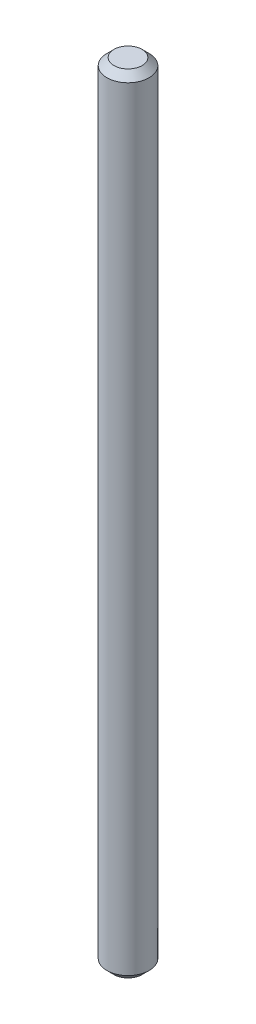
ISO-10303-21;
HEADER;
FILE_DESCRIPTION(('STEP AP214'),'2;1');
FILE_NAME('part.step','',(''),(''),'','','');
FILE_SCHEMA(('AUTOMOTIVE_DESIGN { 1 0 10303 214 1 1 1 1 }'));
ENDSEC;
DATA;
#1=APPLICATION_CONTEXT('core data for automotive mechanical design processes');
#2=APPLICATION_PROTOCOL_DEFINITION('international standard','automotive_design',2000,#1);
#3=PRODUCT_CONTEXT('',#1,'mechanical');
#4=PRODUCT('Part','Part','',(#3));
#5=PRODUCT_RELATED_PRODUCT_CATEGORY('part','',(#4));
#6=PRODUCT_DEFINITION_FORMATION('','',#4);
#7=PRODUCT_DEFINITION_CONTEXT('part definition',#1,'design');
#8=PRODUCT_DEFINITION('design','',#6,#7);
#9=PRODUCT_DEFINITION_SHAPE('','',#8);
#10=(LENGTH_UNIT() NAMED_UNIT(*) SI_UNIT(.MILLI.,.METRE.));
#11=(NAMED_UNIT(*) PLANE_ANGLE_UNIT() SI_UNIT($,.RADIAN.));
#12=(NAMED_UNIT(*) SI_UNIT($,.STERADIAN.) SOLID_ANGLE_UNIT());
#13=UNCERTAINTY_MEASURE_WITH_UNIT(LENGTH_MEASURE(1.E-05),#10,'distance_accuracy_value','');
#14=(GEOMETRIC_REPRESENTATION_CONTEXT(3) GLOBAL_UNCERTAINTY_ASSIGNED_CONTEXT((#13)) GLOBAL_UNIT_ASSIGNED_CONTEXT((#10,
#11,#12)) REPRESENTATION_CONTEXT('',''));
#15=CARTESIAN_POINT('',(0.,0.,0.));
#16=DIRECTION('',(0.,0.,1.));
#17=DIRECTION('',(1.,0.,0.));
#18=AXIS2_PLACEMENT_3D('',#15,#16,#17);
#19=CARTESIAN_POINT('',(0.,-51.,0.));
#20=DIRECTION('',(0.,-1.,0.));
#21=DIRECTION('',(0.,0.,-1.));
#22=AXIS2_PLACEMENT_3D('',#19,#20,#21);
#23=PLANE('',#22);
#24=CARTESIAN_POINT('',(0.,-51.,0.));
#25=DIRECTION('',(0.,-1.,0.));
#26=DIRECTION('',(0.,0.,-1.));
#27=AXIS2_PLACEMENT_3D('',#24,#25,#26);
#28=CIRCLE('',#27,1.00000000000001);
#29=CARTESIAN_POINT('',(0.,-51.,-1.00000000000001));
#30=VERTEX_POINT('',#29);
#31=EDGE_CURVE('E10',#30,#30,#28,.T.);
#32=ORIENTED_EDGE('',*,*,#31,.T.);
#33=EDGE_LOOP('',(#32));
#34=FACE_BOUND('',#33,.T.);
#35=ADVANCED_FACE('F28',(#34),#23,.T.);
#36=CARTESIAN_POINT('',(0.,-51.,0.));
#37=DIRECTION('',(0.,1.,0.));
#38=DIRECTION('',(0.,0.,1.));
#39=AXIS2_PLACEMENT_3D('',#36,#37,#38);
#40=CONICAL_SURFACE('',#39,1.00000000000001,0.785398163397454);
#41=CARTESIAN_POINT('',(0.,-50.5,0.));
#42=DIRECTION('',(0.,-1.,0.));
#43=DIRECTION('',(0.,0.,-1.));
#44=AXIS2_PLACEMENT_3D('',#41,#42,#43);
#45=CIRCLE('',#44,1.50000000000001);
#46=CARTESIAN_POINT('',(0.,-50.5,-1.50000000000001));
#47=VERTEX_POINT('',#46);
#48=EDGE_CURVE('E34',#47,#47,#45,.T.);
#49=ORIENTED_EDGE('',*,*,#48,.T.);
#50=EDGE_LOOP('',(#49));
#51=FACE_BOUND('',#50,.T.);
#52=ORIENTED_EDGE('',*,*,#31,.F.);
#53=EDGE_LOOP('',(#52));
#54=FACE_BOUND('',#53,.T.);
#55=ADVANCED_FACE('F60',(#51,#54),#40,.T.);
#56=CARTESIAN_POINT('',(0.,5.,0.));
#57=DIRECTION('',(0.,-1.,0.));
#58=DIRECTION('',(0.,0.,-1.));
#59=AXIS2_PLACEMENT_3D('',#56,#57,#58);
#60=CYLINDRICAL_SURFACE('',#59,1.5);
#61=CARTESIAN_POINT('',(0.,4.5,0.));
#62=DIRECTION('',(0.,-1.,0.));
#63=DIRECTION('',(0.,0.,-1.));
#64=AXIS2_PLACEMENT_3D('',#61,#62,#63);
#65=CIRCLE('',#64,1.5);
#66=CARTESIAN_POINT('',(0.,4.5,-1.5));
#67=VERTEX_POINT('',#66);
#68=EDGE_CURVE('E38',#67,#67,#65,.T.);
#69=ORIENTED_EDGE('',*,*,#68,.T.);
#70=EDGE_LOOP('',(#69));
#71=FACE_BOUND('',#70,.T.);
#72=ORIENTED_EDGE('',*,*,#48,.F.);
#73=EDGE_LOOP('',(#72));
#74=FACE_BOUND('',#73,.T.);
#75=ADVANCED_FACE('F57',(#71,#74),#60,.T.);
#76=CARTESIAN_POINT('',(0.,4.5,0.));
#77=DIRECTION('',(0.,-1.,0.));
#78=DIRECTION('',(0.,0.,-1.));
#79=AXIS2_PLACEMENT_3D('',#76,#77,#78);
#80=CONICAL_SURFACE('',#79,1.5,0.785398163397442);
#81=CARTESIAN_POINT('',(0.,5.,0.));
#82=DIRECTION('',(0.,-1.,0.));
#83=DIRECTION('',(0.,0.,-1.));
#84=AXIS2_PLACEMENT_3D('',#81,#82,#83);
#85=CIRCLE('',#84,1.00000000000001);
#86=CARTESIAN_POINT('',(0.,5.,-1.00000000000001));
#87=VERTEX_POINT('',#86);
#88=EDGE_CURVE('E42',#87,#87,#85,.T.);
#89=ORIENTED_EDGE('',*,*,#88,.T.);
#90=EDGE_LOOP('',(#89));
#91=FACE_BOUND('',#90,.T.);
#92=ORIENTED_EDGE('',*,*,#68,.F.);
#93=EDGE_LOOP('',(#92));
#94=FACE_BOUND('',#93,.T.);
#95=ADVANCED_FACE('F48',(#91,#94),#80,.T.);
#96=CARTESIAN_POINT('',(0.,5.,0.));
#97=DIRECTION('',(0.,1.,0.));
#98=DIRECTION('',(0.,0.,1.));
#99=AXIS2_PLACEMENT_3D('',#96,#97,#98);
#100=PLANE('',#99);
#101=ORIENTED_EDGE('',*,*,#88,.F.);
#102=EDGE_LOOP('',(#101));
#103=FACE_BOUND('',#102,.T.);
#104=ADVANCED_FACE('F51',(#103),#100,.T.);
#105=CLOSED_SHELL('',(#35,#55,#75,#95,#104));
#106=MANIFOLD_SOLID_BREP('B2',#105);
#107=ADVANCED_BREP_SHAPE_REPRESENTATION('',(#18,#106),#14);
#108=SHAPE_DEFINITION_REPRESENTATION(#9,#107);
ENDSEC;
END-ISO-10303-21;
